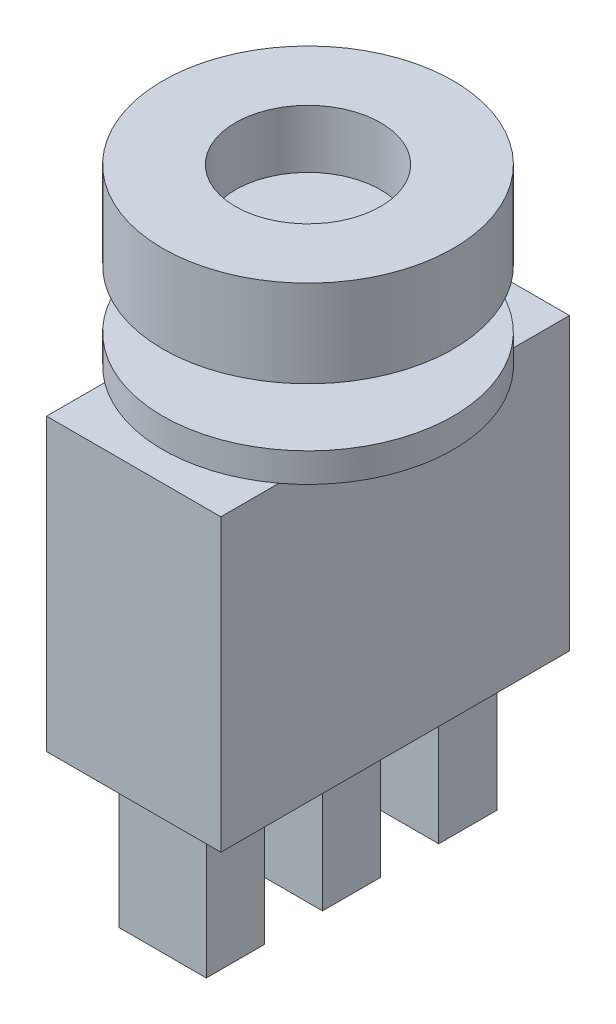
ISO-10303-21;
HEADER;
FILE_DESCRIPTION(('STEP AP214'),'2;1');
FILE_NAME('part.step','',(''),(''),'','','');
FILE_SCHEMA(('AUTOMOTIVE_DESIGN { 1 0 10303 214 1 1 1 1 }'));
ENDSEC;
DATA;
#1=APPLICATION_CONTEXT('core data for automotive mechanical design processes');
#2=APPLICATION_PROTOCOL_DEFINITION('international standard','automotive_design',2000,#1);
#3=PRODUCT_CONTEXT('',#1,'mechanical');
#4=PRODUCT('Part','Part','',(#3));
#5=PRODUCT_RELATED_PRODUCT_CATEGORY('part','',(#4));
#6=PRODUCT_DEFINITION_FORMATION('','',#4);
#7=PRODUCT_DEFINITION_CONTEXT('part definition',#1,'design');
#8=PRODUCT_DEFINITION('design','',#6,#7);
#9=PRODUCT_DEFINITION_SHAPE('','',#8);
#10=(LENGTH_UNIT() NAMED_UNIT(*) SI_UNIT(.MILLI.,.METRE.));
#11=(NAMED_UNIT(*) PLANE_ANGLE_UNIT() SI_UNIT($,.RADIAN.));
#12=(NAMED_UNIT(*) SI_UNIT($,.STERADIAN.) SOLID_ANGLE_UNIT());
#13=UNCERTAINTY_MEASURE_WITH_UNIT(LENGTH_MEASURE(1.E-05),#10,'distance_accuracy_value','');
#14=(GEOMETRIC_REPRESENTATION_CONTEXT(3) GLOBAL_UNCERTAINTY_ASSIGNED_CONTEXT((#13)) GLOBAL_UNIT_ASSIGNED_CONTEXT((#10,
#11,#12)) REPRESENTATION_CONTEXT('',''));
#15=CARTESIAN_POINT('',(0.,0.,0.));
#16=DIRECTION('',(0.,0.,1.));
#17=DIRECTION('',(1.,0.,0.));
#18=AXIS2_PLACEMENT_3D('',#15,#16,#17);
#19=CARTESIAN_POINT('',(3.,-13.,-6.));
#20=DIRECTION('',(0.,-1.,0.));
#21=DIRECTION('',(0.,0.,-1.));
#22=AXIS2_PLACEMENT_3D('',#19,#20,#21);
#23=PLANE('',#22);
#24=DIRECTION('',(1.,0.,0.));
#25=VECTOR('',#24,1.);
#26=CARTESIAN_POINT('',(-1.5,-13.,-1.));
#27=LINE('',#26,#25);
#28=CARTESIAN_POINT('',(-1.5,-13.,-1.));
#29=VERTEX_POINT('',#28);
#30=CARTESIAN_POINT('',(1.5,-13.,-1.));
#31=VERTEX_POINT('',#30);
#32=EDGE_CURVE('E189',#29,#31,#27,.T.);
#33=ORIENTED_EDGE('',*,*,#32,.F.);
#34=DIRECTION('',(0.,0.,-1.));
#35=VECTOR('',#34,1.);
#36=CARTESIAN_POINT('',(-1.5,-13.,-1.));
#37=LINE('',#36,#35);
#38=CARTESIAN_POINT('',(-1.5,-13.,1.));
#39=VERTEX_POINT('',#38);
#40=EDGE_CURVE('E186',#39,#29,#37,.T.);
#41=ORIENTED_EDGE('',*,*,#40,.F.);
#42=DIRECTION('',(-1.,0.,0.));
#43=VECTOR('',#42,1.);
#44=CARTESIAN_POINT('',(-1.5,-13.,1.));
#45=LINE('',#44,#43);
#46=CARTESIAN_POINT('',(1.5,-13.,1.));
#47=VERTEX_POINT('',#46);
#48=EDGE_CURVE('E198',#47,#39,#45,.T.);
#49=ORIENTED_EDGE('',*,*,#48,.F.);
#50=DIRECTION('',(0.,0.,1.));
#51=VECTOR('',#50,1.);
#52=CARTESIAN_POINT('',(1.5,-13.,-1.));
#53=LINE('',#52,#51);
#54=EDGE_CURVE('E206',#31,#47,#53,.T.);
#55=ORIENTED_EDGE('',*,*,#54,.F.);
#56=EDGE_LOOP('',(#33,#41,#49,#55));
#57=FACE_BOUND('',#56,.T.);
#58=DIRECTION('',(0.,0.,1.));
#59=VECTOR('',#58,1.);
#60=CARTESIAN_POINT('',(3.,-13.,-6.));
#61=LINE('',#60,#59);
#62=CARTESIAN_POINT('',(3.,-13.,-6.));
#63=VERTEX_POINT('',#62);
#64=CARTESIAN_POINT('',(3.,-13.,6.));
#65=VERTEX_POINT('',#64);
#66=EDGE_CURVE('E246',#63,#65,#61,.T.);
#67=ORIENTED_EDGE('',*,*,#66,.T.);
#68=DIRECTION('',(-1.,0.,0.));
#69=VECTOR('',#68,1.);
#70=CARTESIAN_POINT('',(3.,-13.,6.));
#71=LINE('',#70,#69);
#72=CARTESIAN_POINT('',(-3.,-13.,6.));
#73=VERTEX_POINT('',#72);
#74=EDGE_CURVE('E249',#65,#73,#71,.T.);
#75=ORIENTED_EDGE('',*,*,#74,.T.);
#76=DIRECTION('',(0.,0.,-1.));
#77=VECTOR('',#76,1.);
#78=CARTESIAN_POINT('',(-3.,-13.,-6.));
#79=LINE('',#78,#77);
#80=CARTESIAN_POINT('',(-3.,-13.,-6.));
#81=VERTEX_POINT('',#80);
#82=EDGE_CURVE('E252',#73,#81,#79,.T.);
#83=ORIENTED_EDGE('',*,*,#82,.T.);
#84=DIRECTION('',(1.,0.,0.));
#85=VECTOR('',#84,1.);
#86=CARTESIAN_POINT('',(3.,-13.,-6.));
#87=LINE('',#86,#85);
#88=EDGE_CURVE('E254',#81,#63,#87,.T.);
#89=ORIENTED_EDGE('',*,*,#88,.T.);
#90=EDGE_LOOP('',(#67,#75,#83,#89));
#91=FACE_BOUND('',#90,.T.);
#92=DIRECTION('',(1.,0.,0.));
#93=VECTOR('',#92,1.);
#94=CARTESIAN_POINT('',(-1.5,-13.,3.));
#95=LINE('',#94,#93);
#96=CARTESIAN_POINT('',(-1.5,-13.,3.));
#97=VERTEX_POINT('',#96);
#98=CARTESIAN_POINT('',(1.5,-13.,3.));
#99=VERTEX_POINT('',#98);
#100=EDGE_CURVE('E231',#97,#99,#95,.T.);
#101=ORIENTED_EDGE('',*,*,#100,.F.);
#102=DIRECTION('',(0.,0.,-1.));
#103=VECTOR('',#102,1.);
#104=CARTESIAN_POINT('',(-1.5,-13.,3.));
#105=LINE('',#104,#103);
#106=CARTESIAN_POINT('',(-1.5,-13.,5.));
#107=VERTEX_POINT('',#106);
#108=EDGE_CURVE('E217',#107,#97,#105,.T.);
#109=ORIENTED_EDGE('',*,*,#108,.F.);
#110=DIRECTION('',(-1.,0.,0.));
#111=VECTOR('',#110,1.);
#112=CARTESIAN_POINT('',(-1.5,-13.,5.));
#113=LINE('',#112,#111);
#114=CARTESIAN_POINT('',(1.5,-13.,5.));
#115=VERTEX_POINT('',#114);
#116=EDGE_CURVE('E222',#115,#107,#113,.T.);
#117=ORIENTED_EDGE('',*,*,#116,.F.);
#118=DIRECTION('',(0.,0.,1.));
#119=VECTOR('',#118,1.);
#120=CARTESIAN_POINT('',(1.5,-13.,3.));
#121=LINE('',#120,#119);
#122=EDGE_CURVE('E233',#99,#115,#121,.T.);
#123=ORIENTED_EDGE('',*,*,#122,.F.);
#124=EDGE_LOOP('',(#101,#109,#117,#123));
#125=FACE_BOUND('',#124,.T.);
#126=DIRECTION('',(1.,0.,0.));
#127=VECTOR('',#126,1.);
#128=CARTESIAN_POINT('',(-1.5,-13.,-5.));
#129=LINE('',#128,#127);
#130=CARTESIAN_POINT('',(-1.5,-13.,-5.));
#131=VERTEX_POINT('',#130);
#132=CARTESIAN_POINT('',(1.5,-13.,-5.));
#133=VERTEX_POINT('',#132);
#134=EDGE_CURVE('E388',#131,#133,#129,.T.);
#135=ORIENTED_EDGE('',*,*,#134,.F.);
#136=DIRECTION('',(0.,0.,-1.));
#137=VECTOR('',#136,1.);
#138=CARTESIAN_POINT('',(-1.5,-13.,-5.));
#139=LINE('',#138,#137);
#140=CARTESIAN_POINT('',(-1.5,-13.,-3.));
#141=VERTEX_POINT('',#140);
#142=EDGE_CURVE('E184',#141,#131,#139,.T.);
#143=ORIENTED_EDGE('',*,*,#142,.F.);
#144=DIRECTION('',(-1.,0.,0.));
#145=VECTOR('',#144,1.);
#146=CARTESIAN_POINT('',(-1.5,-13.,-3.));
#147=LINE('',#146,#145);
#148=CARTESIAN_POINT('',(1.5,-13.,-3.));
#149=VERTEX_POINT('',#148);
#150=EDGE_CURVE('E180',#149,#141,#147,.T.);
#151=ORIENTED_EDGE('',*,*,#150,.F.);
#152=DIRECTION('',(0.,0.,1.));
#153=VECTOR('',#152,1.);
#154=CARTESIAN_POINT('',(1.5,-13.,-5.));
#155=LINE('',#154,#153);
#156=EDGE_CURVE('E390',#133,#149,#155,.T.);
#157=ORIENTED_EDGE('',*,*,#156,.F.);
#158=EDGE_LOOP('',(#135,#143,#151,#157));
#159=FACE_BOUND('',#158,.T.);
#160=ADVANCED_FACE('F31',(#57,#91,#125,#159),#23,.T.);
#161=CARTESIAN_POINT('',(0.,-3.,0.));
#162=DIRECTION('',(0.,-1.,0.));
#163=DIRECTION('',(0.,0.,-1.));
#164=AXIS2_PLACEMENT_3D('',#161,#162,#163);
#165=PLANE('',#164);
#166=DIRECTION('',(0.,0.,1.));
#167=VECTOR('',#166,1.);
#168=CARTESIAN_POINT('',(3.,-3.,-6.));
#169=LINE('',#168,#167);
#170=CARTESIAN_POINT('',(3.,-3.,-4.));
#171=VERTEX_POINT('',#170);
#172=CARTESIAN_POINT('',(3.,-3.,4.));
#173=VERTEX_POINT('',#172);
#174=EDGE_CURVE('E11',#171,#173,#169,.T.);
#175=ORIENTED_EDGE('',*,*,#174,.F.);
#176=CARTESIAN_POINT('',(0.,-3.,0.));
#177=DIRECTION('',(0.,-1.,0.));
#178=DIRECTION('',(0.,0.,-1.));
#179=AXIS2_PLACEMENT_3D('',#176,#177,#178);
#180=CIRCLE('',#179,5.);
#181=EDGE_CURVE('E277',#171,#173,#180,.T.);
#182=ORIENTED_EDGE('',*,*,#181,.T.);
#183=EDGE_LOOP('',(#175,#182));
#184=FACE_BOUND('',#183,.T.);
#185=ADVANCED_FACE('F297',(#184),#165,.T.);
#186=CARTESIAN_POINT('',(0.,0.,0.));
#187=DIRECTION('',(0.,1.,0.));
#188=DIRECTION('',(0.,0.,1.));
#189=AXIS2_PLACEMENT_3D('',#186,#187,#188);
#190=PLANE('',#189);
#191=CARTESIAN_POINT('',(0.,0.,0.));
#192=DIRECTION('',(0.,1.,0.));
#193=DIRECTION('',(0.,0.,1.));
#194=AXIS2_PLACEMENT_3D('',#191,#192,#193);
#195=CIRCLE('',#194,5.);
#196=CARTESIAN_POINT('',(0.,0.,5.));
#197=VERTEX_POINT('',#196);
#198=EDGE_CURVE('E287',#197,#197,#195,.T.);
#199=ORIENTED_EDGE('',*,*,#198,.F.);
#200=EDGE_LOOP('',(#199));
#201=FACE_BOUND('',#200,.T.);
#202=CARTESIAN_POINT('',(0.,0.,0.));
#203=DIRECTION('',(0.,1.,0.));
#204=DIRECTION('',(0.,0.,1.));
#205=AXIS2_PLACEMENT_3D('',#202,#203,#204);
#206=CIRCLE('',#205,2.);
#207=CARTESIAN_POINT('',(0.,0.,2.));
#208=VERTEX_POINT('',#207);
#209=EDGE_CURVE('E35',#208,#208,#206,.F.);
#210=ORIENTED_EDGE('',*,*,#209,.F.);
#211=EDGE_LOOP('',(#210));
#212=FACE_BOUND('',#211,.T.);
#213=ADVANCED_FACE('F294',(#201,#212),#190,.F.);
#214=CARTESIAN_POINT('',(0.,3.,0.));
#215=DIRECTION('',(0.,-1.,0.));
#216=DIRECTION('',(0.,0.,-1.));
#217=AXIS2_PLACEMENT_3D('',#214,#215,#216);
#218=CYLINDRICAL_SURFACE('',#217,5.);
#219=CARTESIAN_POINT('',(0.,3.,0.));
#220=DIRECTION('',(0.,1.,0.));
#221=DIRECTION('',(0.,0.,1.));
#222=AXIS2_PLACEMENT_3D('',#219,#220,#221);
#223=CIRCLE('',#222,5.);
#224=CARTESIAN_POINT('',(0.,3.,5.));
#225=VERTEX_POINT('',#224);
#226=EDGE_CURVE('E288',#225,#225,#223,.T.);
#227=ORIENTED_EDGE('',*,*,#226,.F.);
#228=EDGE_LOOP('',(#227));
#229=FACE_BOUND('',#228,.T.);
#230=ORIENTED_EDGE('',*,*,#198,.T.);
#231=EDGE_LOOP('',(#230));
#232=FACE_BOUND('',#231,.T.);
#233=ADVANCED_FACE('F33',(#229,#232),#218,.T.);
#234=CARTESIAN_POINT('',(0.,3.,0.));
#235=DIRECTION('',(0.,1.,0.));
#236=DIRECTION('',(0.,0.,1.));
#237=AXIS2_PLACEMENT_3D('',#234,#235,#236);
#238=PLANE('',#237);
#239=CARTESIAN_POINT('',(0.,3.,0.));
#240=DIRECTION('',(0.,1.,0.));
#241=DIRECTION('',(0.,0.,1.));
#242=AXIS2_PLACEMENT_3D('',#239,#240,#241);
#243=CIRCLE('',#242,2.5);
#244=CARTESIAN_POINT('',(0.,3.,2.5));
#245=VERTEX_POINT('',#244);
#246=EDGE_CURVE('E376',#245,#245,#243,.T.);
#247=ORIENTED_EDGE('',*,*,#246,.F.);
#248=EDGE_LOOP('',(#247));
#249=FACE_BOUND('',#248,.T.);
#250=ORIENTED_EDGE('',*,*,#226,.T.);
#251=EDGE_LOOP('',(#250));
#252=FACE_BOUND('',#251,.T.);
#253=ADVANCED_FACE('F365',(#249,#252),#238,.T.);
#254=CARTESIAN_POINT('',(0.,-2.,0.));
#255=DIRECTION('',(0.,1.,0.));
#256=DIRECTION('',(0.,0.,1.));
#257=AXIS2_PLACEMENT_3D('',#254,#255,#256);
#258=CYLINDRICAL_SURFACE('',#257,2.);
#259=CARTESIAN_POINT('',(0.,-2.,0.));
#260=DIRECTION('',(0.,-1.,0.));
#261=DIRECTION('',(0.,0.,-1.));
#262=AXIS2_PLACEMENT_3D('',#259,#260,#261);
#263=CIRCLE('',#262,2.);
#264=CARTESIAN_POINT('',(0.,-2.,-2.));
#265=VERTEX_POINT('',#264);
#266=EDGE_CURVE('E280',#265,#265,#263,.T.);
#267=ORIENTED_EDGE('',*,*,#266,.F.);
#268=EDGE_LOOP('',(#267));
#269=FACE_BOUND('',#268,.T.);
#270=ORIENTED_EDGE('',*,*,#209,.T.);
#271=EDGE_LOOP('',(#270));
#272=FACE_BOUND('',#271,.T.);
#273=ADVANCED_FACE('F360',(#269,#272),#258,.T.);
#274=CARTESIAN_POINT('',(0.,-2.,0.));
#275=DIRECTION('',(0.,-1.,0.));
#276=DIRECTION('',(0.,0.,-1.));
#277=AXIS2_PLACEMENT_3D('',#274,#275,#276);
#278=PLANE('',#277);
#279=CARTESIAN_POINT('',(0.,-2.,0.));
#280=DIRECTION('',(0.,-1.,0.));
#281=DIRECTION('',(0.,0.,-1.));
#282=AXIS2_PLACEMENT_3D('',#279,#280,#281);
#283=CIRCLE('',#282,5.);
#284=CARTESIAN_POINT('',(0.,-2.,-5.));
#285=VERTEX_POINT('',#284);
#286=EDGE_CURVE('E276',#285,#285,#283,.T.);
#287=ORIENTED_EDGE('',*,*,#286,.F.);
#288=EDGE_LOOP('',(#287));
#289=FACE_BOUND('',#288,.T.);
#290=ORIENTED_EDGE('',*,*,#266,.T.);
#291=EDGE_LOOP('',(#290));
#292=FACE_BOUND('',#291,.T.);
#293=ADVANCED_FACE('F355',(#289,#292),#278,.F.);
#294=CARTESIAN_POINT('',(0.,-3.,0.));
#295=DIRECTION('',(0.,1.,0.));
#296=DIRECTION('',(0.,0.,1.));
#297=AXIS2_PLACEMENT_3D('',#294,#295,#296);
#298=CYLINDRICAL_SURFACE('',#297,5.);
#299=ORIENTED_EDGE('',*,*,#181,.F.);
#300=CARTESIAN_POINT('',(-3.,-3.,-4.));
#301=VERTEX_POINT('',#300);
#302=EDGE_CURVE('E282',#301,#171,#180,.T.);
#303=ORIENTED_EDGE('',*,*,#302,.F.);
#304=CARTESIAN_POINT('',(-3.,-3.,4.));
#305=VERTEX_POINT('',#304);
#306=EDGE_CURVE('E334',#305,#301,#180,.T.);
#307=ORIENTED_EDGE('',*,*,#306,.F.);
#308=EDGE_CURVE('E281',#173,#305,#180,.T.);
#309=ORIENTED_EDGE('',*,*,#308,.F.);
#310=EDGE_LOOP('',(#299,#303,#307,#309));
#311=FACE_BOUND('',#310,.T.);
#312=ORIENTED_EDGE('',*,*,#286,.T.);
#313=EDGE_LOOP('',(#312));
#314=FACE_BOUND('',#313,.T.);
#315=ADVANCED_FACE('F337',(#311,#314),#298,.T.);
#316=DIRECTION('',(0.,0.,-1.));
#317=VECTOR('',#316,1.);
#318=CARTESIAN_POINT('',(-3.,-3.,-6.));
#319=LINE('',#318,#317);
#320=EDGE_CURVE('E40',#305,#301,#319,.T.);
#321=ORIENTED_EDGE('',*,*,#320,.F.);
#322=ORIENTED_EDGE('',*,*,#306,.T.);
#323=EDGE_LOOP('',(#321,#322));
#324=FACE_BOUND('',#323,.T.);
#325=ADVANCED_FACE('F336',(#324),#165,.T.);
#326=CARTESIAN_POINT('',(3.,-3.,-6.));
#327=DIRECTION('',(0.,-1.,0.));
#328=DIRECTION('',(0.,0.,-1.));
#329=AXIS2_PLACEMENT_3D('',#326,#327,#328);
#330=PLANE('',#329);
#331=CARTESIAN_POINT('',(3.,-3.,6.));
#332=VERTEX_POINT('',#331);
#333=EDGE_CURVE('E43',#173,#332,#169,.T.);
#334=ORIENTED_EDGE('',*,*,#333,.F.);
#335=ORIENTED_EDGE('',*,*,#308,.T.);
#336=CARTESIAN_POINT('',(-3.,-3.,6.));
#337=VERTEX_POINT('',#336);
#338=EDGE_CURVE('E261',#337,#305,#319,.T.);
#339=ORIENTED_EDGE('',*,*,#338,.F.);
#340=DIRECTION('',(-1.,0.,0.));
#341=VECTOR('',#340,1.);
#342=CARTESIAN_POINT('',(3.,-3.,6.));
#343=LINE('',#342,#341);
#344=EDGE_CURVE('E258',#332,#337,#343,.T.);
#345=ORIENTED_EDGE('',*,*,#344,.F.);
#346=EDGE_LOOP('',(#334,#335,#339,#345));
#347=FACE_BOUND('',#346,.T.);
#348=ADVANCED_FACE('F330',(#347),#330,.F.);
#349=CARTESIAN_POINT('',(-3.,-3.,-6.));
#350=VERTEX_POINT('',#349);
#351=EDGE_CURVE('E260',#301,#350,#319,.T.);
#352=ORIENTED_EDGE('',*,*,#351,.F.);
#353=ORIENTED_EDGE('',*,*,#302,.T.);
#354=CARTESIAN_POINT('',(3.,-3.,-6.));
#355=VERTEX_POINT('',#354);
#356=EDGE_CURVE('E42',#355,#171,#169,.T.);
#357=ORIENTED_EDGE('',*,*,#356,.F.);
#358=DIRECTION('',(1.,0.,0.));
#359=VECTOR('',#358,1.);
#360=CARTESIAN_POINT('',(3.,-3.,-6.));
#361=LINE('',#360,#359);
#362=EDGE_CURVE('E250',#350,#355,#361,.T.);
#363=ORIENTED_EDGE('',*,*,#362,.F.);
#364=EDGE_LOOP('',(#352,#353,#357,#363));
#365=FACE_BOUND('',#364,.T.);
#366=ADVANCED_FACE('F315',(#365),#330,.F.);
#367=CARTESIAN_POINT('',(3.,-13.,-6.));
#368=DIRECTION('',(-1.,0.,0.));
#369=DIRECTION('',(0.,0.,1.));
#370=AXIS2_PLACEMENT_3D('',#367,#368,#369);
#371=PLANE('',#370);
#372=ORIENTED_EDGE('',*,*,#356,.T.);
#373=ORIENTED_EDGE('',*,*,#174,.T.);
#374=ORIENTED_EDGE('',*,*,#333,.T.);
#375=DIRECTION('',(0.,1.,0.));
#376=VECTOR('',#375,1.);
#377=CARTESIAN_POINT('',(3.,-13.,6.));
#378=LINE('',#377,#376);
#379=EDGE_CURVE('E273',#65,#332,#378,.T.);
#380=ORIENTED_EDGE('',*,*,#379,.F.);
#381=ORIENTED_EDGE('',*,*,#66,.F.);
#382=DIRECTION('',(0.,1.,0.));
#383=VECTOR('',#382,1.);
#384=CARTESIAN_POINT('',(3.,-13.,-6.));
#385=LINE('',#384,#383);
#386=EDGE_CURVE('E255',#63,#355,#385,.T.);
#387=ORIENTED_EDGE('',*,*,#386,.T.);
#388=EDGE_LOOP('',(#372,#373,#374,#380,#381,#387));
#389=FACE_BOUND('',#388,.T.);
#390=ADVANCED_FACE('F318',(#389),#371,.F.);
#391=CARTESIAN_POINT('',(3.,-13.,6.));
#392=DIRECTION('',(0.,0.,-1.));
#393=DIRECTION('',(-1.,0.,0.));
#394=AXIS2_PLACEMENT_3D('',#391,#392,#393);
#395=PLANE('',#394);
#396=ORIENTED_EDGE('',*,*,#344,.T.);
#397=DIRECTION('',(0.,1.,0.));
#398=VECTOR('',#397,1.);
#399=CARTESIAN_POINT('',(-3.,-13.,6.));
#400=LINE('',#399,#398);
#401=EDGE_CURVE('E270',#73,#337,#400,.T.);
#402=ORIENTED_EDGE('',*,*,#401,.F.);
#403=ORIENTED_EDGE('',*,*,#74,.F.);
#404=ORIENTED_EDGE('',*,*,#379,.T.);
#405=EDGE_LOOP('',(#396,#402,#403,#404));
#406=FACE_BOUND('',#405,.T.);
#407=ADVANCED_FACE('F457',(#406),#395,.F.);
#408=CARTESIAN_POINT('',(-3.,-13.,-6.));
#409=DIRECTION('',(1.,0.,0.));
#410=DIRECTION('',(0.,0.,-1.));
#411=AXIS2_PLACEMENT_3D('',#408,#409,#410);
#412=PLANE('',#411);
#413=ORIENTED_EDGE('',*,*,#338,.T.);
#414=ORIENTED_EDGE('',*,*,#320,.T.);
#415=ORIENTED_EDGE('',*,*,#351,.T.);
#416=DIRECTION('',(0.,1.,0.));
#417=VECTOR('',#416,1.);
#418=CARTESIAN_POINT('',(-3.,-13.,-6.));
#419=LINE('',#418,#417);
#420=EDGE_CURVE('E267',#81,#350,#419,.T.);
#421=ORIENTED_EDGE('',*,*,#420,.F.);
#422=ORIENTED_EDGE('',*,*,#82,.F.);
#423=ORIENTED_EDGE('',*,*,#401,.T.);
#424=EDGE_LOOP('',(#413,#414,#415,#421,#422,#423));
#425=FACE_BOUND('',#424,.T.);
#426=ADVANCED_FACE('F305',(#425),#412,.F.);
#427=CARTESIAN_POINT('',(3.,-13.,-6.));
#428=DIRECTION('',(0.,0.,1.));
#429=DIRECTION('',(1.,0.,0.));
#430=AXIS2_PLACEMENT_3D('',#427,#428,#429);
#431=PLANE('',#430);
#432=ORIENTED_EDGE('',*,*,#362,.T.);
#433=ORIENTED_EDGE('',*,*,#386,.F.);
#434=ORIENTED_EDGE('',*,*,#88,.F.);
#435=ORIENTED_EDGE('',*,*,#420,.T.);
#436=EDGE_LOOP('',(#432,#433,#434,#435));
#437=FACE_BOUND('',#436,.T.);
#438=ADVANCED_FACE('F312',(#437),#431,.F.);
#439=CARTESIAN_POINT('',(-1.5,-18.,3.));
#440=DIRECTION('',(1.,0.,0.));
#441=DIRECTION('',(0.,0.,-1.));
#442=AXIS2_PLACEMENT_3D('',#439,#440,#441);
#443=PLANE('',#442);
#444=ORIENTED_EDGE('',*,*,#108,.T.);
#445=DIRECTION('',(0.,1.,0.));
#446=VECTOR('',#445,1.);
#447=CARTESIAN_POINT('',(-1.5,-18.,3.));
#448=LINE('',#447,#446);
#449=CARTESIAN_POINT('',(-1.5,-18.,3.));
#450=VERTEX_POINT('',#449);
#451=EDGE_CURVE('E244',#450,#97,#448,.T.);
#452=ORIENTED_EDGE('',*,*,#451,.F.);
#453=DIRECTION('',(0.,0.,-1.));
#454=VECTOR('',#453,1.);
#455=CARTESIAN_POINT('',(-1.5,-18.,3.));
#456=LINE('',#455,#454);
#457=CARTESIAN_POINT('',(-1.5,-18.,5.));
#458=VERTEX_POINT('',#457);
#459=EDGE_CURVE('E218',#458,#450,#456,.T.);
#460=ORIENTED_EDGE('',*,*,#459,.F.);
#461=DIRECTION('',(0.,1.,0.));
#462=VECTOR('',#461,1.);
#463=CARTESIAN_POINT('',(-1.5,-18.,5.));
#464=LINE('',#463,#462);
#465=EDGE_CURVE('E228',#458,#107,#464,.T.);
#466=ORIENTED_EDGE('',*,*,#465,.T.);
#467=EDGE_LOOP('',(#444,#452,#460,#466));
#468=FACE_BOUND('',#467,.T.);
#469=ADVANCED_FACE('F448',(#468),#443,.F.);
#470=CARTESIAN_POINT('',(-1.5,-18.,3.));
#471=DIRECTION('',(0.,0.,1.));
#472=DIRECTION('',(1.,0.,0.));
#473=AXIS2_PLACEMENT_3D('',#470,#471,#472);
#474=PLANE('',#473);
#475=ORIENTED_EDGE('',*,*,#100,.T.);
#476=DIRECTION('',(0.,1.,0.));
#477=VECTOR('',#476,1.);
#478=CARTESIAN_POINT('',(1.5,-18.,3.));
#479=LINE('',#478,#477);
#480=CARTESIAN_POINT('',(1.5,-18.,3.));
#481=VERTEX_POINT('',#480);
#482=EDGE_CURVE('E241',#481,#99,#479,.T.);
#483=ORIENTED_EDGE('',*,*,#482,.F.);
#484=DIRECTION('',(1.,0.,0.));
#485=VECTOR('',#484,1.);
#486=CARTESIAN_POINT('',(-1.5,-18.,3.));
#487=LINE('',#486,#485);
#488=EDGE_CURVE('E221',#450,#481,#487,.T.);
#489=ORIENTED_EDGE('',*,*,#488,.F.);
#490=ORIENTED_EDGE('',*,*,#451,.T.);
#491=EDGE_LOOP('',(#475,#483,#489,#490));
#492=FACE_BOUND('',#491,.T.);
#493=ADVANCED_FACE('F444',(#492),#474,.F.);
#494=CARTESIAN_POINT('',(1.5,-18.,3.));
#495=DIRECTION('',(-1.,0.,0.));
#496=DIRECTION('',(0.,0.,1.));
#497=AXIS2_PLACEMENT_3D('',#494,#495,#496);
#498=PLANE('',#497);
#499=ORIENTED_EDGE('',*,*,#122,.T.);
#500=DIRECTION('',(0.,1.,0.));
#501=VECTOR('',#500,1.);
#502=CARTESIAN_POINT('',(1.5,-18.,5.));
#503=LINE('',#502,#501);
#504=CARTESIAN_POINT('',(1.5,-18.,5.));
#505=VERTEX_POINT('',#504);
#506=EDGE_CURVE('E239',#505,#115,#503,.T.);
#507=ORIENTED_EDGE('',*,*,#506,.F.);
#508=DIRECTION('',(0.,0.,1.));
#509=VECTOR('',#508,1.);
#510=CARTESIAN_POINT('',(1.5,-18.,3.));
#511=LINE('',#510,#509);
#512=EDGE_CURVE('E224',#481,#505,#511,.T.);
#513=ORIENTED_EDGE('',*,*,#512,.F.);
#514=ORIENTED_EDGE('',*,*,#482,.T.);
#515=EDGE_LOOP('',(#499,#507,#513,#514));
#516=FACE_BOUND('',#515,.T.);
#517=ADVANCED_FACE('F440',(#516),#498,.F.);
#518=CARTESIAN_POINT('',(-1.5,-18.,5.));
#519=DIRECTION('',(0.,0.,-1.));
#520=DIRECTION('',(-1.,0.,0.));
#521=AXIS2_PLACEMENT_3D('',#518,#519,#520);
#522=PLANE('',#521);
#523=ORIENTED_EDGE('',*,*,#116,.T.);
#524=ORIENTED_EDGE('',*,*,#465,.F.);
#525=DIRECTION('',(-1.,0.,0.));
#526=VECTOR('',#525,1.);
#527=CARTESIAN_POINT('',(-1.5,-18.,5.));
#528=LINE('',#527,#526);
#529=EDGE_CURVE('E226',#505,#458,#528,.T.);
#530=ORIENTED_EDGE('',*,*,#529,.F.);
#531=ORIENTED_EDGE('',*,*,#506,.T.);
#532=EDGE_LOOP('',(#523,#524,#530,#531));
#533=FACE_BOUND('',#532,.T.);
#534=ADVANCED_FACE('F436',(#533),#522,.F.);
#535=CARTESIAN_POINT('',(-1.5,-18.,5.));
#536=DIRECTION('',(0.,1.,0.));
#537=DIRECTION('',(0.,0.,1.));
#538=AXIS2_PLACEMENT_3D('',#535,#536,#537);
#539=PLANE('',#538);
#540=ORIENTED_EDGE('',*,*,#459,.T.);
#541=ORIENTED_EDGE('',*,*,#488,.T.);
#542=ORIENTED_EDGE('',*,*,#512,.T.);
#543=ORIENTED_EDGE('',*,*,#529,.T.);
#544=EDGE_LOOP('',(#540,#541,#542,#543));
#545=FACE_BOUND('',#544,.T.);
#546=ADVANCED_FACE('F432',(#545),#539,.F.);
#547=CARTESIAN_POINT('',(-1.5,-18.,-1.));
#548=DIRECTION('',(1.,0.,0.));
#549=DIRECTION('',(0.,0.,-1.));
#550=AXIS2_PLACEMENT_3D('',#547,#548,#549);
#551=PLANE('',#550);
#552=ORIENTED_EDGE('',*,*,#40,.T.);
#553=DIRECTION('',(0.,1.,0.));
#554=VECTOR('',#553,1.);
#555=CARTESIAN_POINT('',(-1.5,-18.,-1.));
#556=LINE('',#555,#554);
#557=CARTESIAN_POINT('',(-1.5,-18.,-1.));
#558=VERTEX_POINT('',#557);
#559=EDGE_CURVE('E215',#558,#29,#556,.T.);
#560=ORIENTED_EDGE('',*,*,#559,.F.);
#561=DIRECTION('',(0.,0.,-1.));
#562=VECTOR('',#561,1.);
#563=CARTESIAN_POINT('',(-1.5,-18.,-1.));
#564=LINE('',#563,#562);
#565=CARTESIAN_POINT('',(-1.5,-18.,1.));
#566=VERTEX_POINT('',#565);
#567=EDGE_CURVE('E194',#566,#558,#564,.T.);
#568=ORIENTED_EDGE('',*,*,#567,.F.);
#569=DIRECTION('',(0.,1.,0.));
#570=VECTOR('',#569,1.);
#571=CARTESIAN_POINT('',(-1.5,-18.,1.));
#572=LINE('',#571,#570);
#573=EDGE_CURVE('E203',#566,#39,#572,.T.);
#574=ORIENTED_EDGE('',*,*,#573,.T.);
#575=EDGE_LOOP('',(#552,#560,#568,#574));
#576=FACE_BOUND('',#575,.T.);
#577=ADVANCED_FACE('F428',(#576),#551,.F.);
#578=CARTESIAN_POINT('',(-1.5,-18.,-1.));
#579=DIRECTION('',(0.,0.,1.));
#580=DIRECTION('',(1.,0.,0.));
#581=AXIS2_PLACEMENT_3D('',#578,#579,#580);
#582=PLANE('',#581);
#583=ORIENTED_EDGE('',*,*,#32,.T.);
#584=DIRECTION('',(0.,1.,0.));
#585=VECTOR('',#584,1.);
#586=CARTESIAN_POINT('',(1.5,-18.,-1.));
#587=LINE('',#586,#585);
#588=CARTESIAN_POINT('',(1.5,-18.,-1.));
#589=VERTEX_POINT('',#588);
#590=EDGE_CURVE('E212',#589,#31,#587,.T.);
#591=ORIENTED_EDGE('',*,*,#590,.F.);
#592=DIRECTION('',(1.,0.,0.));
#593=VECTOR('',#592,1.);
#594=CARTESIAN_POINT('',(-1.5,-18.,-1.));
#595=LINE('',#594,#593);
#596=EDGE_CURVE('E197',#558,#589,#595,.T.);
#597=ORIENTED_EDGE('',*,*,#596,.F.);
#598=ORIENTED_EDGE('',*,*,#559,.T.);
#599=EDGE_LOOP('',(#583,#591,#597,#598));
#600=FACE_BOUND('',#599,.T.);
#601=ADVANCED_FACE('F424',(#600),#582,.F.);
#602=CARTESIAN_POINT('',(1.5,-18.,-1.));
#603=DIRECTION('',(-1.,0.,0.));
#604=DIRECTION('',(0.,0.,1.));
#605=AXIS2_PLACEMENT_3D('',#602,#603,#604);
#606=PLANE('',#605);
#607=ORIENTED_EDGE('',*,*,#54,.T.);
#608=DIRECTION('',(0.,1.,0.));
#609=VECTOR('',#608,1.);
#610=CARTESIAN_POINT('',(1.5,-18.,1.));
#611=LINE('',#610,#609);
#612=CARTESIAN_POINT('',(1.5,-18.,1.));
#613=VERTEX_POINT('',#612);
#614=EDGE_CURVE('E58',#613,#47,#611,.T.);
#615=ORIENTED_EDGE('',*,*,#614,.F.);
#616=DIRECTION('',(0.,0.,1.));
#617=VECTOR('',#616,1.);
#618=CARTESIAN_POINT('',(1.5,-18.,-1.));
#619=LINE('',#618,#617);
#620=EDGE_CURVE('E200',#589,#613,#619,.T.);
#621=ORIENTED_EDGE('',*,*,#620,.F.);
#622=ORIENTED_EDGE('',*,*,#590,.T.);
#623=EDGE_LOOP('',(#607,#615,#621,#622));
#624=FACE_BOUND('',#623,.T.);
#625=ADVANCED_FACE('F421',(#624),#606,.F.);
#626=CARTESIAN_POINT('',(-1.5,-18.,1.));
#627=DIRECTION('',(0.,0.,-1.));
#628=DIRECTION('',(-1.,0.,0.));
#629=AXIS2_PLACEMENT_3D('',#626,#627,#628);
#630=PLANE('',#629);
#631=ORIENTED_EDGE('',*,*,#48,.T.);
#632=ORIENTED_EDGE('',*,*,#573,.F.);
#633=DIRECTION('',(-1.,0.,0.));
#634=VECTOR('',#633,1.);
#635=CARTESIAN_POINT('',(-1.5,-18.,1.));
#636=LINE('',#635,#634);
#637=EDGE_CURVE('E202',#613,#566,#636,.T.);
#638=ORIENTED_EDGE('',*,*,#637,.F.);
#639=ORIENTED_EDGE('',*,*,#614,.T.);
#640=EDGE_LOOP('',(#631,#632,#638,#639));
#641=FACE_BOUND('',#640,.T.);
#642=ADVANCED_FACE('F417',(#641),#630,.F.);
#643=CARTESIAN_POINT('',(-1.5,-18.,1.));
#644=DIRECTION('',(0.,1.,0.));
#645=DIRECTION('',(0.,0.,1.));
#646=AXIS2_PLACEMENT_3D('',#643,#644,#645);
#647=PLANE('',#646);
#648=ORIENTED_EDGE('',*,*,#567,.T.);
#649=ORIENTED_EDGE('',*,*,#596,.T.);
#650=ORIENTED_EDGE('',*,*,#620,.T.);
#651=ORIENTED_EDGE('',*,*,#637,.T.);
#652=EDGE_LOOP('',(#648,#649,#650,#651));
#653=FACE_BOUND('',#652,.T.);
#654=ADVANCED_FACE('F414',(#653),#647,.F.);
#655=CARTESIAN_POINT('',(-1.5,-18.,-5.));
#656=DIRECTION('',(1.,0.,0.));
#657=DIRECTION('',(0.,0.,-1.));
#658=AXIS2_PLACEMENT_3D('',#655,#656,#657);
#659=PLANE('',#658);
#660=ORIENTED_EDGE('',*,*,#142,.T.);
#661=DIRECTION('',(0.,1.,0.));
#662=VECTOR('',#661,1.);
#663=CARTESIAN_POINT('',(-1.5,-18.,-5.));
#664=LINE('',#663,#662);
#665=CARTESIAN_POINT('',(-1.5,-18.,-5.));
#666=VERTEX_POINT('',#665);
#667=EDGE_CURVE('E165',#666,#131,#664,.T.);
#668=ORIENTED_EDGE('',*,*,#667,.F.);
#669=DIRECTION('',(0.,0.,-1.));
#670=VECTOR('',#669,1.);
#671=CARTESIAN_POINT('',(-1.5,-18.,-5.));
#672=LINE('',#671,#670);
#673=CARTESIAN_POINT('',(-1.5,-18.,-3.));
#674=VERTEX_POINT('',#673);
#675=EDGE_CURVE('E172',#674,#666,#672,.T.);
#676=ORIENTED_EDGE('',*,*,#675,.F.);
#677=DIRECTION('',(0.,1.,0.));
#678=VECTOR('',#677,1.);
#679=CARTESIAN_POINT('',(-1.5,-18.,-3.));
#680=LINE('',#679,#678);
#681=EDGE_CURVE('E386',#674,#141,#680,.T.);
#682=ORIENTED_EDGE('',*,*,#681,.T.);
#683=EDGE_LOOP('',(#660,#668,#676,#682));
#684=FACE_BOUND('',#683,.T.);
#685=ADVANCED_FACE('F182',(#684),#659,.F.);
#686=CARTESIAN_POINT('',(-1.5,-18.,-5.));
#687=DIRECTION('',(0.,0.,1.));
#688=DIRECTION('',(1.,0.,0.));
#689=AXIS2_PLACEMENT_3D('',#686,#687,#688);
#690=PLANE('',#689);
#691=ORIENTED_EDGE('',*,*,#134,.T.);
#692=DIRECTION('',(0.,1.,0.));
#693=VECTOR('',#692,1.);
#694=CARTESIAN_POINT('',(1.5,-18.,-5.));
#695=LINE('',#694,#693);
#696=CARTESIAN_POINT('',(1.5,-18.,-5.));
#697=VERTEX_POINT('',#696);
#698=EDGE_CURVE('E168',#697,#133,#695,.T.);
#699=ORIENTED_EDGE('',*,*,#698,.F.);
#700=DIRECTION('',(1.,0.,0.));
#701=VECTOR('',#700,1.);
#702=CARTESIAN_POINT('',(-1.5,-18.,-5.));
#703=LINE('',#702,#701);
#704=EDGE_CURVE('E161',#666,#697,#703,.T.);
#705=ORIENTED_EDGE('',*,*,#704,.F.);
#706=ORIENTED_EDGE('',*,*,#667,.T.);
#707=EDGE_LOOP('',(#691,#699,#705,#706));
#708=FACE_BOUND('',#707,.T.);
#709=ADVANCED_FACE('F163',(#708),#690,.F.);
#710=CARTESIAN_POINT('',(1.5,-18.,-5.));
#711=DIRECTION('',(-1.,0.,0.));
#712=DIRECTION('',(0.,0.,1.));
#713=AXIS2_PLACEMENT_3D('',#710,#711,#712);
#714=PLANE('',#713);
#715=ORIENTED_EDGE('',*,*,#156,.T.);
#716=DIRECTION('',(0.,1.,0.));
#717=VECTOR('',#716,1.);
#718=CARTESIAN_POINT('',(1.5,-18.,-3.));
#719=LINE('',#718,#717);
#720=CARTESIAN_POINT('',(1.5,-18.,-3.));
#721=VERTEX_POINT('',#720);
#722=EDGE_CURVE('E50',#721,#149,#719,.T.);
#723=ORIENTED_EDGE('',*,*,#722,.F.);
#724=DIRECTION('',(0.,0.,1.));
#725=VECTOR('',#724,1.);
#726=CARTESIAN_POINT('',(1.5,-18.,-5.));
#727=LINE('',#726,#725);
#728=EDGE_CURVE('E171',#697,#721,#727,.T.);
#729=ORIENTED_EDGE('',*,*,#728,.F.);
#730=ORIENTED_EDGE('',*,*,#698,.T.);
#731=EDGE_LOOP('',(#715,#723,#729,#730));
#732=FACE_BOUND('',#731,.T.);
#733=ADVANCED_FACE('F397',(#732),#714,.F.);
#734=CARTESIAN_POINT('',(-1.5,-18.,-3.));
#735=DIRECTION('',(0.,0.,-1.));
#736=DIRECTION('',(-1.,0.,0.));
#737=AXIS2_PLACEMENT_3D('',#734,#735,#736);
#738=PLANE('',#737);
#739=ORIENTED_EDGE('',*,*,#150,.T.);
#740=ORIENTED_EDGE('',*,*,#681,.F.);
#741=DIRECTION('',(-1.,0.,0.));
#742=VECTOR('',#741,1.);
#743=CARTESIAN_POINT('',(-1.5,-18.,-3.));
#744=LINE('',#743,#742);
#745=EDGE_CURVE('E176',#721,#674,#744,.T.);
#746=ORIENTED_EDGE('',*,*,#745,.F.);
#747=ORIENTED_EDGE('',*,*,#722,.T.);
#748=EDGE_LOOP('',(#739,#740,#746,#747));
#749=FACE_BOUND('',#748,.T.);
#750=ADVANCED_FACE('F398',(#749),#738,.F.);
#751=CARTESIAN_POINT('',(-1.5,-18.,-3.));
#752=DIRECTION('',(0.,1.,0.));
#753=DIRECTION('',(0.,0.,1.));
#754=AXIS2_PLACEMENT_3D('',#751,#752,#753);
#755=PLANE('',#754);
#756=ORIENTED_EDGE('',*,*,#675,.T.);
#757=ORIENTED_EDGE('',*,*,#704,.T.);
#758=ORIENTED_EDGE('',*,*,#728,.T.);
#759=ORIENTED_EDGE('',*,*,#745,.T.);
#760=EDGE_LOOP('',(#756,#757,#758,#759));
#761=FACE_BOUND('',#760,.T.);
#762=ADVANCED_FACE('F175',(#761),#755,.F.);
#763=CARTESIAN_POINT('',(0.,1.,0.));
#764=DIRECTION('',(0.,1.,0.));
#765=DIRECTION('',(0.,0.,1.));
#766=AXIS2_PLACEMENT_3D('',#763,#764,#765);
#767=CYLINDRICAL_SURFACE('',#766,2.5);
#768=CARTESIAN_POINT('',(0.,1.,0.));
#769=DIRECTION('',(0.,1.,0.));
#770=DIRECTION('',(0.,0.,1.));
#771=AXIS2_PLACEMENT_3D('',#768,#769,#770);
#772=CIRCLE('',#771,2.5);
#773=CARTESIAN_POINT('',(0.,1.,2.5));
#774=VERTEX_POINT('',#773);
#775=EDGE_CURVE('E379',#774,#774,#772,.T.);
#776=ORIENTED_EDGE('',*,*,#775,.F.);
#777=EDGE_LOOP('',(#776));
#778=FACE_BOUND('',#777,.T.);
#779=ORIENTED_EDGE('',*,*,#246,.T.);
#780=EDGE_LOOP('',(#779));
#781=FACE_BOUND('',#780,.T.);
#782=ADVANCED_FACE('F405',(#778,#781),#767,.F.);
#783=CARTESIAN_POINT('',(0.,1.,0.));
#784=DIRECTION('',(0.,1.,0.));
#785=DIRECTION('',(0.,0.,1.));
#786=AXIS2_PLACEMENT_3D('',#783,#784,#785);
#787=PLANE('',#786);
#788=ORIENTED_EDGE('',*,*,#775,.T.);
#789=EDGE_LOOP('',(#788));
#790=FACE_BOUND('',#789,.T.);
#791=ADVANCED_FACE('F521',(#790),#787,.T.);
#792=CLOSED_SHELL('',(#160,#185,#213,#233,#253,#273,#293,#315,#325,#348,#366,#390,#407,#426,
#438,#469,#493,#517,#534,#546,#577,#601,#625,#642,#654,#685,#709,#733,#750,#762,#782,#791));
#793=MANIFOLD_SOLID_BREP('B2',#792);
#794=ADVANCED_BREP_SHAPE_REPRESENTATION('',(#18,#793),#14);
#795=SHAPE_DEFINITION_REPRESENTATION(#9,#794);
ENDSEC;
END-ISO-10303-21;
